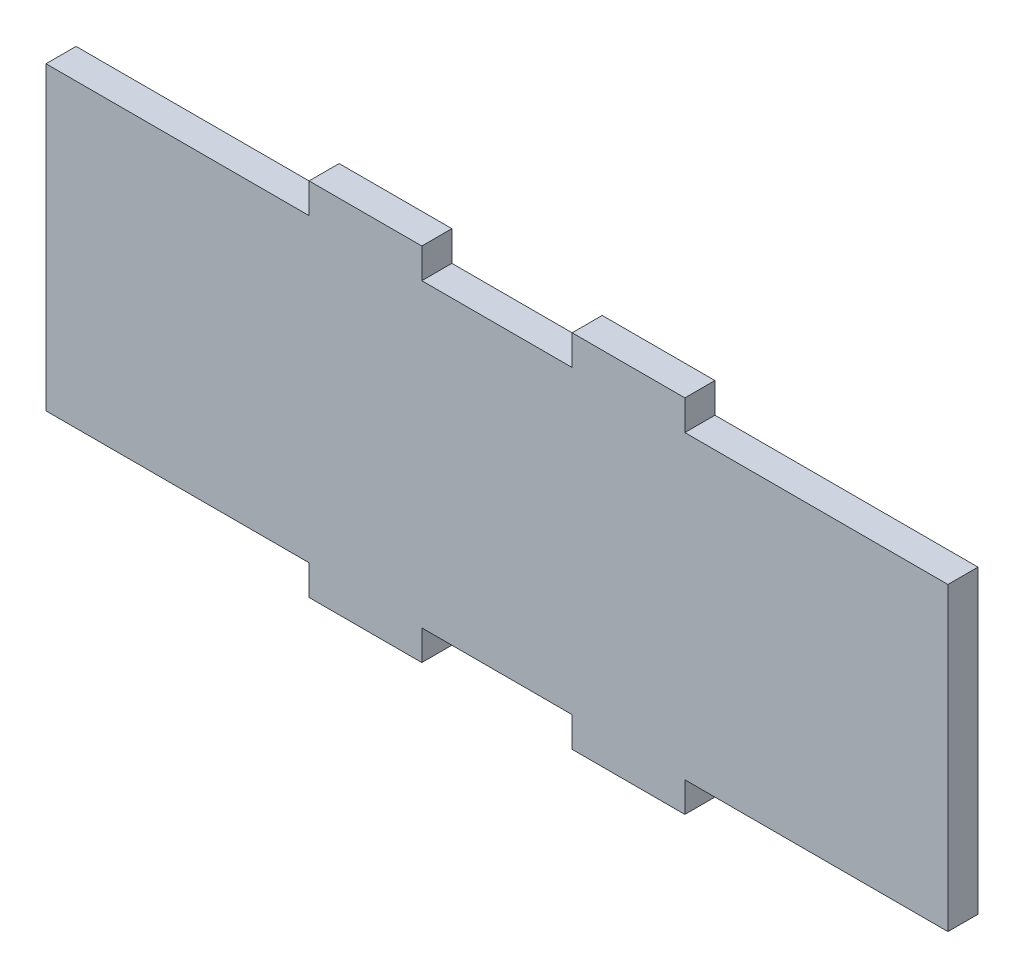
ISO-10303-21;
HEADER;
FILE_DESCRIPTION(('STEP AP214'),'2;1');
FILE_NAME('part.step','',(''),(''),'','','');
FILE_SCHEMA(('AUTOMOTIVE_DESIGN { 1 0 10303 214 1 1 1 1 }'));
ENDSEC;
DATA;
#1=APPLICATION_CONTEXT('core data for automotive mechanical design processes');
#2=APPLICATION_PROTOCOL_DEFINITION('international standard','automotive_design',2000,#1);
#3=PRODUCT_CONTEXT('',#1,'mechanical');
#4=PRODUCT('Part','Part','',(#3));
#5=PRODUCT_RELATED_PRODUCT_CATEGORY('part','',(#4));
#6=PRODUCT_DEFINITION_FORMATION('','',#4);
#7=PRODUCT_DEFINITION_CONTEXT('part definition',#1,'design');
#8=PRODUCT_DEFINITION('design','',#6,#7);
#9=PRODUCT_DEFINITION_SHAPE('','',#8);
#10=(LENGTH_UNIT() NAMED_UNIT(*) SI_UNIT(.MILLI.,.METRE.));
#11=(NAMED_UNIT(*) PLANE_ANGLE_UNIT() SI_UNIT($,.RADIAN.));
#12=(NAMED_UNIT(*) SI_UNIT($,.STERADIAN.) SOLID_ANGLE_UNIT());
#13=UNCERTAINTY_MEASURE_WITH_UNIT(LENGTH_MEASURE(1.E-05),#10,'distance_accuracy_value','');
#14=(GEOMETRIC_REPRESENTATION_CONTEXT(3) GLOBAL_UNCERTAINTY_ASSIGNED_CONTEXT((#13)) GLOBAL_UNIT_ASSIGNED_CONTEXT((#10,
#11,#12)) REPRESENTATION_CONTEXT('',''));
#15=CARTESIAN_POINT('',(0.,0.,0.));
#16=DIRECTION('',(0.,0.,1.));
#17=DIRECTION('',(1.,0.,0.));
#18=AXIS2_PLACEMENT_3D('',#15,#16,#17);
#19=CARTESIAN_POINT('',(60.,48.,-2.));
#20=DIRECTION('',(-1.,0.,0.));
#21=DIRECTION('',(0.,0.,1.));
#22=AXIS2_PLACEMENT_3D('',#19,#20,#21);
#23=PLANE('',#22);
#24=DIRECTION('',(0.,-1.,0.));
#25=VECTOR('',#24,1.);
#26=CARTESIAN_POINT('',(60.,48.,-2.));
#27=LINE('',#26,#25);
#28=CARTESIAN_POINT('',(60.,44.,-2.));
#29=VERTEX_POINT('',#28);
#30=CARTESIAN_POINT('',(60.,4.,-2.));
#31=VERTEX_POINT('',#30);
#32=EDGE_CURVE('E303',#29,#31,#27,.T.);
#33=ORIENTED_EDGE('',*,*,#32,.F.);
#34=DIRECTION('',(0.,0.,1.));
#35=VECTOR('',#34,1.);
#36=CARTESIAN_POINT('',(60.,44.,-46.));
#37=LINE('',#36,#35);
#38=CARTESIAN_POINT('',(60.,44.,2.));
#39=VERTEX_POINT('',#38);
#40=EDGE_CURVE('E202',#29,#39,#37,.T.);
#41=ORIENTED_EDGE('',*,*,#40,.T.);
#42=DIRECTION('',(0.,-1.,0.));
#43=VECTOR('',#42,1.);
#44=CARTESIAN_POINT('',(60.,48.,2.));
#45=LINE('',#44,#43);
#46=CARTESIAN_POINT('',(60.,4.,2.));
#47=VERTEX_POINT('',#46);
#48=EDGE_CURVE('E295',#39,#47,#45,.T.);
#49=ORIENTED_EDGE('',*,*,#48,.T.);
#50=DIRECTION('',(0.,0.,1.));
#51=VECTOR('',#50,1.);
#52=CARTESIAN_POINT('',(60.,4.,-46.));
#53=LINE('',#52,#51);
#54=EDGE_CURVE('E178',#31,#47,#53,.T.);
#55=ORIENTED_EDGE('',*,*,#54,.F.);
#56=EDGE_LOOP('',(#33,#41,#49,#55));
#57=FACE_BOUND('',#56,.T.);
#58=ADVANCED_FACE('F34',(#57),#23,.F.);
#59=CARTESIAN_POINT('',(-60.,48.,-2.));
#60=DIRECTION('',(0.,0.,1.));
#61=DIRECTION('',(1.,0.,0.));
#62=AXIS2_PLACEMENT_3D('',#59,#60,#61);
#63=PLANE('',#62);
#64=DIRECTION('',(-1.,0.,0.));
#65=VECTOR('',#64,1.);
#66=CARTESIAN_POINT('',(-60.,48.,-2.));
#67=LINE('',#66,#65);
#68=CARTESIAN_POINT('',(-10.,48.,-2.));
#69=VERTEX_POINT('',#68);
#70=CARTESIAN_POINT('',(-25.,48.,-2.));
#71=VERTEX_POINT('',#70);
#72=EDGE_CURVE('E282',#69,#71,#67,.T.);
#73=ORIENTED_EDGE('',*,*,#72,.F.);
#74=DIRECTION('',(0.,-1.,0.));
#75=VECTOR('',#74,1.);
#76=CARTESIAN_POINT('',(-10.,48.,-2.));
#77=LINE('',#76,#75);
#78=CARTESIAN_POINT('',(-10.,44.,-2.));
#79=VERTEX_POINT('',#78);
#80=EDGE_CURVE('E263',#69,#79,#77,.T.);
#81=ORIENTED_EDGE('',*,*,#80,.T.);
#82=DIRECTION('',(1.,0.,0.));
#83=VECTOR('',#82,1.);
#84=CARTESIAN_POINT('',(-60.,44.,-2.));
#85=LINE('',#84,#83);
#86=CARTESIAN_POINT('',(10.,44.,-2.));
#87=VERTEX_POINT('',#86);
#88=EDGE_CURVE('E278',#79,#87,#85,.T.);
#89=ORIENTED_EDGE('',*,*,#88,.T.);
#90=DIRECTION('',(0.,-1.,0.));
#91=VECTOR('',#90,1.);
#92=CARTESIAN_POINT('',(9.99999999999999,48.0000000000001,-2.));
#93=LINE('',#92,#91);
#94=CARTESIAN_POINT('',(9.99999999999999,48.,-2.));
#95=VERTEX_POINT('',#94);
#96=EDGE_CURVE('E261',#95,#87,#93,.T.);
#97=ORIENTED_EDGE('',*,*,#96,.F.);
#98=CARTESIAN_POINT('',(25.,48.,-2.));
#99=VERTEX_POINT('',#98);
#100=EDGE_CURVE('E285',#99,#95,#67,.T.);
#101=ORIENTED_EDGE('',*,*,#100,.F.);
#102=DIRECTION('',(0.,-1.,0.));
#103=VECTOR('',#102,1.);
#104=CARTESIAN_POINT('',(25.,48.0000000000001,-2.));
#105=LINE('',#104,#103);
#106=CARTESIAN_POINT('',(25.,44.,-2.));
#107=VERTEX_POINT('',#106);
#108=EDGE_CURVE('E258',#99,#107,#105,.T.);
#109=ORIENTED_EDGE('',*,*,#108,.T.);
#110=DIRECTION('',(1.,0.,0.));
#111=VECTOR('',#110,1.);
#112=CARTESIAN_POINT('',(-60.,44.,-2.));
#113=LINE('',#112,#111);
#114=EDGE_CURVE('E275',#107,#29,#113,.T.);
#115=ORIENTED_EDGE('',*,*,#114,.T.);
#116=ORIENTED_EDGE('',*,*,#32,.T.);
#117=DIRECTION('',(1.,0.,0.));
#118=VECTOR('',#117,1.);
#119=CARTESIAN_POINT('',(-60.,4.,-2.));
#120=LINE('',#119,#118);
#121=CARTESIAN_POINT('',(25.,4.,-2.));
#122=VERTEX_POINT('',#121);
#123=EDGE_CURVE('E269',#122,#31,#120,.T.);
#124=ORIENTED_EDGE('',*,*,#123,.F.);
#125=DIRECTION('',(0.,-1.,0.));
#126=VECTOR('',#125,1.);
#127=CARTESIAN_POINT('',(25.,48.,-2.));
#128=LINE('',#127,#126);
#129=CARTESIAN_POINT('',(25.,0.,-2.));
#130=VERTEX_POINT('',#129);
#131=EDGE_CURVE('E175',#122,#130,#128,.T.);
#132=ORIENTED_EDGE('',*,*,#131,.T.);
#133=DIRECTION('',(-1.,0.,0.));
#134=VECTOR('',#133,1.);
#135=CARTESIAN_POINT('',(-60.,0.,-2.));
#136=LINE('',#135,#134);
#137=CARTESIAN_POINT('',(10.,0.,-2.));
#138=VERTEX_POINT('',#137);
#139=EDGE_CURVE('E293',#130,#138,#136,.T.);
#140=ORIENTED_EDGE('',*,*,#139,.T.);
#141=DIRECTION('',(0.,-1.,0.));
#142=VECTOR('',#141,1.);
#143=CARTESIAN_POINT('',(10.,48.,-2.));
#144=LINE('',#143,#142);
#145=CARTESIAN_POINT('',(10.,4.,-2.));
#146=VERTEX_POINT('',#145);
#147=EDGE_CURVE('E252',#146,#138,#144,.T.);
#148=ORIENTED_EDGE('',*,*,#147,.F.);
#149=DIRECTION('',(1.,0.,0.));
#150=VECTOR('',#149,1.);
#151=CARTESIAN_POINT('',(-60.,4.,-2.));
#152=LINE('',#151,#150);
#153=CARTESIAN_POINT('',(-9.99999999999999,4.,-2.));
#154=VERTEX_POINT('',#153);
#155=EDGE_CURVE('E271',#154,#146,#152,.T.);
#156=ORIENTED_EDGE('',*,*,#155,.F.);
#157=DIRECTION('',(0.,-1.,0.));
#158=VECTOR('',#157,1.);
#159=CARTESIAN_POINT('',(-9.99999999999999,48.,-2.));
#160=LINE('',#159,#158);
#161=CARTESIAN_POINT('',(-9.99999999999999,0.,-2.));
#162=VERTEX_POINT('',#161);
#163=EDGE_CURVE('E249',#154,#162,#160,.T.);
#164=ORIENTED_EDGE('',*,*,#163,.T.);
#165=CARTESIAN_POINT('',(-25.,0.,-2.));
#166=VERTEX_POINT('',#165);
#167=EDGE_CURVE('E281',#162,#166,#136,.T.);
#168=ORIENTED_EDGE('',*,*,#167,.T.);
#169=DIRECTION('',(0.,-1.,0.));
#170=VECTOR('',#169,1.);
#171=CARTESIAN_POINT('',(-25.,48.,-2.));
#172=LINE('',#171,#170);
#173=CARTESIAN_POINT('',(-25.,4.,-2.));
#174=VERTEX_POINT('',#173);
#175=EDGE_CURVE('E254',#174,#166,#172,.T.);
#176=ORIENTED_EDGE('',*,*,#175,.F.);
#177=DIRECTION('',(1.,0.,0.));
#178=VECTOR('',#177,1.);
#179=CARTESIAN_POINT('',(-60.,4.,-2.));
#180=LINE('',#179,#178);
#181=CARTESIAN_POINT('',(-60.,4.,-2.));
#182=VERTEX_POINT('',#181);
#183=EDGE_CURVE('E273',#182,#174,#180,.T.);
#184=ORIENTED_EDGE('',*,*,#183,.F.);
#185=DIRECTION('',(0.,-1.,0.));
#186=VECTOR('',#185,1.);
#187=CARTESIAN_POINT('',(-60.,48.,-2.));
#188=LINE('',#187,#186);
#189=CARTESIAN_POINT('',(-60.,44.,-2.));
#190=VERTEX_POINT('',#189);
#191=EDGE_CURVE('E300',#190,#182,#188,.T.);
#192=ORIENTED_EDGE('',*,*,#191,.F.);
#193=DIRECTION('',(1.,0.,0.));
#194=VECTOR('',#193,1.);
#195=CARTESIAN_POINT('',(-60.,44.,-2.));
#196=LINE('',#195,#194);
#197=CARTESIAN_POINT('',(-25.,44.,-2.));
#198=VERTEX_POINT('',#197);
#199=EDGE_CURVE('E266',#190,#198,#196,.T.);
#200=ORIENTED_EDGE('',*,*,#199,.T.);
#201=DIRECTION('',(0.,-1.,0.));
#202=VECTOR('',#201,1.);
#203=CARTESIAN_POINT('',(-25.,48.,-2.));
#204=LINE('',#203,#202);
#205=EDGE_CURVE('E256',#71,#198,#204,.T.);
#206=ORIENTED_EDGE('',*,*,#205,.F.);
#207=EDGE_LOOP('',(#73,#81,#89,#97,#101,#109,#115,#116,#124,#132,#140,#148,#156,#164,#168,#176,
#184,#192,#200,#206));
#208=FACE_BOUND('',#207,.T.);
#209=ADVANCED_FACE('F332',(#208),#63,.F.);
#210=CARTESIAN_POINT('',(-60.,48.,-2.));
#211=DIRECTION('',(1.,0.,0.));
#212=DIRECTION('',(0.,0.,-1.));
#213=AXIS2_PLACEMENT_3D('',#210,#211,#212);
#214=PLANE('',#213);
#215=DIRECTION('',(0.,0.,1.));
#216=VECTOR('',#215,1.);
#217=CARTESIAN_POINT('',(-60.,4.,-46.));
#218=LINE('',#217,#216);
#219=CARTESIAN_POINT('',(-60.,4.,2.));
#220=VERTEX_POINT('',#219);
#221=EDGE_CURVE('E228',#182,#220,#218,.T.);
#222=ORIENTED_EDGE('',*,*,#221,.T.);
#223=DIRECTION('',(0.,-1.,0.));
#224=VECTOR('',#223,1.);
#225=CARTESIAN_POINT('',(-60.,48.,2.));
#226=LINE('',#225,#224);
#227=CARTESIAN_POINT('',(-60.,44.,2.));
#228=VERTEX_POINT('',#227);
#229=EDGE_CURVE('E297',#228,#220,#226,.T.);
#230=ORIENTED_EDGE('',*,*,#229,.F.);
#231=DIRECTION('',(0.,0.,1.));
#232=VECTOR('',#231,1.);
#233=CARTESIAN_POINT('',(-60.,44.,-46.));
#234=LINE('',#233,#232);
#235=EDGE_CURVE('E244',#190,#228,#234,.T.);
#236=ORIENTED_EDGE('',*,*,#235,.F.);
#237=ORIENTED_EDGE('',*,*,#191,.T.);
#238=EDGE_LOOP('',(#222,#230,#236,#237));
#239=FACE_BOUND('',#238,.T.);
#240=ADVANCED_FACE('F356',(#239),#214,.F.);
#241=CARTESIAN_POINT('',(-60.,48.,2.));
#242=DIRECTION('',(0.,0.,-1.));
#243=DIRECTION('',(-1.,0.,0.));
#244=AXIS2_PLACEMENT_3D('',#241,#242,#243);
#245=PLANE('',#244);
#246=DIRECTION('',(1.,0.,0.));
#247=VECTOR('',#246,1.);
#248=CARTESIAN_POINT('',(0.,44.,2.));
#249=LINE('',#248,#247);
#250=CARTESIAN_POINT('',(-10.,44.,2.));
#251=VERTEX_POINT('',#250);
#252=CARTESIAN_POINT('',(10.,44.,2.));
#253=VERTEX_POINT('',#252);
#254=EDGE_CURVE('E201',#251,#253,#249,.T.);
#255=ORIENTED_EDGE('',*,*,#254,.F.);
#256=DIRECTION('',(0.,-1.,0.));
#257=VECTOR('',#256,1.);
#258=CARTESIAN_POINT('',(-10.,0.,2.));
#259=LINE('',#258,#257);
#260=CARTESIAN_POINT('',(-10.,48.,2.));
#261=VERTEX_POINT('',#260);
#262=EDGE_CURVE('E198',#261,#251,#259,.T.);
#263=ORIENTED_EDGE('',*,*,#262,.F.);
#264=DIRECTION('',(1.,0.,0.));
#265=VECTOR('',#264,1.);
#266=CARTESIAN_POINT('',(-60.,48.,2.));
#267=LINE('',#266,#265);
#268=CARTESIAN_POINT('',(-25.,48.,2.));
#269=VERTEX_POINT('',#268);
#270=EDGE_CURVE('E290',#269,#261,#267,.T.);
#271=ORIENTED_EDGE('',*,*,#270,.F.);
#272=DIRECTION('',(0.,-1.,0.));
#273=VECTOR('',#272,1.);
#274=CARTESIAN_POINT('',(-25.,0.,2.));
#275=LINE('',#274,#273);
#276=CARTESIAN_POINT('',(-25.,44.,2.));
#277=VERTEX_POINT('',#276);
#278=EDGE_CURVE('E56',#269,#277,#275,.T.);
#279=ORIENTED_EDGE('',*,*,#278,.T.);
#280=DIRECTION('',(1.,0.,0.));
#281=VECTOR('',#280,1.);
#282=CARTESIAN_POINT('',(0.,44.,2.));
#283=LINE('',#282,#281);
#284=EDGE_CURVE('E209',#228,#277,#283,.T.);
#285=ORIENTED_EDGE('',*,*,#284,.F.);
#286=ORIENTED_EDGE('',*,*,#229,.T.);
#287=DIRECTION('',(1.,0.,0.));
#288=VECTOR('',#287,1.);
#289=CARTESIAN_POINT('',(0.,4.,2.));
#290=LINE('',#289,#288);
#291=CARTESIAN_POINT('',(-25.,4.,2.));
#292=VERTEX_POINT('',#291);
#293=EDGE_CURVE('E221',#220,#292,#290,.T.);
#294=ORIENTED_EDGE('',*,*,#293,.T.);
#295=DIRECTION('',(0.,-1.,0.));
#296=VECTOR('',#295,1.);
#297=CARTESIAN_POINT('',(-25.,0.,2.));
#298=LINE('',#297,#296);
#299=CARTESIAN_POINT('',(-25.,0.,2.));
#300=VERTEX_POINT('',#299);
#301=EDGE_CURVE('E224',#292,#300,#298,.T.);
#302=ORIENTED_EDGE('',*,*,#301,.T.);
#303=DIRECTION('',(1.,0.,0.));
#304=VECTOR('',#303,1.);
#305=CARTESIAN_POINT('',(-60.,0.,2.));
#306=LINE('',#305,#304);
#307=CARTESIAN_POINT('',(-9.99999999999999,0.,2.));
#308=VERTEX_POINT('',#307);
#309=EDGE_CURVE('E286',#300,#308,#306,.T.);
#310=ORIENTED_EDGE('',*,*,#309,.T.);
#311=DIRECTION('',(0.,-1.,0.));
#312=VECTOR('',#311,1.);
#313=CARTESIAN_POINT('',(-9.99999999999999,0.,2.));
#314=LINE('',#313,#312);
#315=CARTESIAN_POINT('',(-9.99999999999999,4.,2.));
#316=VERTEX_POINT('',#315);
#317=EDGE_CURVE('E234',#316,#308,#314,.T.);
#318=ORIENTED_EDGE('',*,*,#317,.F.);
#319=DIRECTION('',(1.,0.,0.));
#320=VECTOR('',#319,1.);
#321=CARTESIAN_POINT('',(0.,4.,2.));
#322=LINE('',#321,#320);
#323=CARTESIAN_POINT('',(10.,4.,2.));
#324=VERTEX_POINT('',#323);
#325=EDGE_CURVE('E196',#316,#324,#322,.T.);
#326=ORIENTED_EDGE('',*,*,#325,.T.);
#327=DIRECTION('',(0.,-1.,0.));
#328=VECTOR('',#327,1.);
#329=CARTESIAN_POINT('',(10.,0.,2.));
#330=LINE('',#329,#328);
#331=CARTESIAN_POINT('',(10.,0.,2.));
#332=VERTEX_POINT('',#331);
#333=EDGE_CURVE('E236',#324,#332,#330,.T.);
#334=ORIENTED_EDGE('',*,*,#333,.T.);
#335=CARTESIAN_POINT('',(25.,0.,2.));
#336=VERTEX_POINT('',#335);
#337=EDGE_CURVE('E193',#332,#336,#306,.T.);
#338=ORIENTED_EDGE('',*,*,#337,.T.);
#339=DIRECTION('',(0.,-1.,0.));
#340=VECTOR('',#339,1.);
#341=CARTESIAN_POINT('',(25.,0.,2.));
#342=LINE('',#341,#340);
#343=CARTESIAN_POINT('',(25.,4.,2.));
#344=VERTEX_POINT('',#343);
#345=EDGE_CURVE('E172',#344,#336,#342,.T.);
#346=ORIENTED_EDGE('',*,*,#345,.F.);
#347=DIRECTION('',(1.,0.,0.));
#348=VECTOR('',#347,1.);
#349=CARTESIAN_POINT('',(0.,4.,2.));
#350=LINE('',#349,#348);
#351=EDGE_CURVE('E181',#344,#47,#350,.T.);
#352=ORIENTED_EDGE('',*,*,#351,.T.);
#353=ORIENTED_EDGE('',*,*,#48,.F.);
#354=DIRECTION('',(1.,0.,0.));
#355=VECTOR('',#354,1.);
#356=CARTESIAN_POINT('',(0.,44.,2.));
#357=LINE('',#356,#355);
#358=CARTESIAN_POINT('',(25.,44.,2.));
#359=VERTEX_POINT('',#358);
#360=EDGE_CURVE('E214',#359,#39,#357,.T.);
#361=ORIENTED_EDGE('',*,*,#360,.F.);
#362=DIRECTION('',(0.,-1.,0.));
#363=VECTOR('',#362,1.);
#364=CARTESIAN_POINT('',(25.0000000000001,0.,2.));
#365=LINE('',#364,#363);
#366=CARTESIAN_POINT('',(25.,48.,2.));
#367=VERTEX_POINT('',#366);
#368=EDGE_CURVE('E211',#367,#359,#365,.T.);
#369=ORIENTED_EDGE('',*,*,#368,.F.);
#370=CARTESIAN_POINT('',(9.99999999999999,48.,2.));
#371=VERTEX_POINT('',#370);
#372=EDGE_CURVE('E287',#371,#367,#267,.T.);
#373=ORIENTED_EDGE('',*,*,#372,.F.);
#374=DIRECTION('',(0.,-1.,0.));
#375=VECTOR('',#374,1.);
#376=CARTESIAN_POINT('',(10.0000000000001,0.,2.));
#377=LINE('',#376,#375);
#378=EDGE_CURVE('E48',#371,#253,#377,.T.);
#379=ORIENTED_EDGE('',*,*,#378,.T.);
#380=EDGE_LOOP('',(#255,#263,#271,#279,#285,#286,#294,#302,#310,#318,#326,#334,#338,#346,#352,
#353,#361,#369,#373,#379));
#381=FACE_BOUND('',#380,.T.);
#382=ADVANCED_FACE('F190',(#381),#245,.F.);
#383=CARTESIAN_POINT('',(0.,48.,0.));
#384=DIRECTION('',(0.,1.,0.));
#385=DIRECTION('',(0.,0.,1.));
#386=AXIS2_PLACEMENT_3D('',#383,#384,#385);
#387=PLANE('',#386);
#388=ORIENTED_EDGE('',*,*,#100,.T.);
#389=DIRECTION('',(0.,0.,1.));
#390=VECTOR('',#389,1.);
#391=CARTESIAN_POINT('',(9.99999999999999,48.,0.));
#392=LINE('',#391,#390);
#393=EDGE_CURVE('E41',#95,#371,#392,.T.);
#394=ORIENTED_EDGE('',*,*,#393,.T.);
#395=ORIENTED_EDGE('',*,*,#372,.T.);
#396=DIRECTION('',(0.,0.,1.));
#397=VECTOR('',#396,1.);
#398=CARTESIAN_POINT('',(25.,48.,0.));
#399=LINE('',#398,#397);
#400=EDGE_CURVE('E317',#99,#367,#399,.T.);
#401=ORIENTED_EDGE('',*,*,#400,.F.);
#402=EDGE_LOOP('',(#388,#394,#395,#401));
#403=FACE_BOUND('',#402,.T.);
#404=ADVANCED_FACE('F321',(#403),#387,.T.);
#405=DIRECTION('',(0.,0.,1.));
#406=VECTOR('',#405,1.);
#407=CARTESIAN_POINT('',(-10.,48.,0.));
#408=LINE('',#407,#406);
#409=EDGE_CURVE('E11',#69,#261,#408,.T.);
#410=ORIENTED_EDGE('',*,*,#409,.F.);
#411=ORIENTED_EDGE('',*,*,#72,.T.);
#412=DIRECTION('',(0.,0.,1.));
#413=VECTOR('',#412,1.);
#414=CARTESIAN_POINT('',(-25.,48.,0.));
#415=LINE('',#414,#413);
#416=EDGE_CURVE('E315',#71,#269,#415,.T.);
#417=ORIENTED_EDGE('',*,*,#416,.T.);
#418=ORIENTED_EDGE('',*,*,#270,.T.);
#419=EDGE_LOOP('',(#410,#411,#417,#418));
#420=FACE_BOUND('',#419,.T.);
#421=ADVANCED_FACE('F344',(#420),#387,.T.);
#422=CARTESIAN_POINT('',(0.,0.,0.));
#423=DIRECTION('',(0.,1.,0.));
#424=DIRECTION('',(0.,0.,1.));
#425=AXIS2_PLACEMENT_3D('',#422,#423,#424);
#426=PLANE('',#425);
#427=DIRECTION('',(0.,0.,1.));
#428=VECTOR('',#427,1.);
#429=CARTESIAN_POINT('',(-25.,0.,0.));
#430=LINE('',#429,#428);
#431=EDGE_CURVE('E313',#166,#300,#430,.T.);
#432=ORIENTED_EDGE('',*,*,#431,.F.);
#433=ORIENTED_EDGE('',*,*,#167,.F.);
#434=DIRECTION('',(0.,0.,1.));
#435=VECTOR('',#434,1.);
#436=CARTESIAN_POINT('',(-9.99999999999999,0.,0.));
#437=LINE('',#436,#435);
#438=EDGE_CURVE('E308',#162,#308,#437,.T.);
#439=ORIENTED_EDGE('',*,*,#438,.T.);
#440=ORIENTED_EDGE('',*,*,#309,.F.);
#441=EDGE_LOOP('',(#432,#433,#439,#440));
#442=FACE_BOUND('',#441,.T.);
#443=ADVANCED_FACE('F369',(#442),#426,.F.);
#444=DIRECTION('',(0.,0.,1.));
#445=VECTOR('',#444,1.);
#446=CARTESIAN_POINT('',(10.,0.,0.));
#447=LINE('',#446,#445);
#448=EDGE_CURVE('E311',#138,#332,#447,.T.);
#449=ORIENTED_EDGE('',*,*,#448,.F.);
#450=ORIENTED_EDGE('',*,*,#139,.F.);
#451=DIRECTION('',(0.,0.,1.));
#452=VECTOR('',#451,1.);
#453=CARTESIAN_POINT('',(25.,0.,0.));
#454=LINE('',#453,#452);
#455=EDGE_CURVE('E306',#130,#336,#454,.T.);
#456=ORIENTED_EDGE('',*,*,#455,.T.);
#457=ORIENTED_EDGE('',*,*,#337,.F.);
#458=EDGE_LOOP('',(#449,#450,#456,#457));
#459=FACE_BOUND('',#458,.T.);
#460=ADVANCED_FACE('F384',(#459),#426,.F.);
#461=CARTESIAN_POINT('',(0.,4.,-46.));
#462=DIRECTION('',(0.,-1.,0.));
#463=DIRECTION('',(1.,0.,0.));
#464=AXIS2_PLACEMENT_3D('',#461,#462,#463);
#465=PLANE('',#464);
#466=ORIENTED_EDGE('',*,*,#123,.T.);
#467=ORIENTED_EDGE('',*,*,#54,.T.);
#468=ORIENTED_EDGE('',*,*,#351,.F.);
#469=DIRECTION('',(0.,0.,1.));
#470=VECTOR('',#469,1.);
#471=CARTESIAN_POINT('',(25.,4.,-46.));
#472=LINE('',#471,#470);
#473=EDGE_CURVE('E168',#122,#344,#472,.T.);
#474=ORIENTED_EDGE('',*,*,#473,.F.);
#475=EDGE_LOOP('',(#466,#467,#468,#474));
#476=FACE_BOUND('',#475,.T.);
#477=ADVANCED_FACE('F182',(#476),#465,.T.);
#478=CARTESIAN_POINT('',(25.,0.,-46.));
#479=DIRECTION('',(-1.,0.,0.));
#480=DIRECTION('',(0.,0.,1.));
#481=AXIS2_PLACEMENT_3D('',#478,#479,#480);
#482=PLANE('',#481);
#483=ORIENTED_EDGE('',*,*,#473,.T.);
#484=ORIENTED_EDGE('',*,*,#345,.T.);
#485=ORIENTED_EDGE('',*,*,#455,.F.);
#486=ORIENTED_EDGE('',*,*,#131,.F.);
#487=EDGE_LOOP('',(#483,#484,#485,#486));
#488=FACE_BOUND('',#487,.T.);
#489=ADVANCED_FACE('F170',(#488),#482,.F.);
#490=CARTESIAN_POINT('',(0.,4.,-46.));
#491=DIRECTION('',(0.,-1.,0.));
#492=DIRECTION('',(1.,0.,0.));
#493=AXIS2_PLACEMENT_3D('',#490,#491,#492);
#494=PLANE('',#493);
#495=ORIENTED_EDGE('',*,*,#155,.T.);
#496=DIRECTION('',(0.,0.,1.));
#497=VECTOR('',#496,1.);
#498=CARTESIAN_POINT('',(10.,4.,-46.));
#499=LINE('',#498,#497);
#500=EDGE_CURVE('E225',#146,#324,#499,.T.);
#501=ORIENTED_EDGE('',*,*,#500,.T.);
#502=ORIENTED_EDGE('',*,*,#325,.F.);
#503=DIRECTION('',(0.,0.,1.));
#504=VECTOR('',#503,1.);
#505=CARTESIAN_POINT('',(-9.99999999999999,4.,-46.));
#506=LINE('',#505,#504);
#507=EDGE_CURVE('E238',#154,#316,#506,.T.);
#508=ORIENTED_EDGE('',*,*,#507,.F.);
#509=EDGE_LOOP('',(#495,#501,#502,#508));
#510=FACE_BOUND('',#509,.T.);
#511=ADVANCED_FACE('F377',(#510),#494,.T.);
#512=CARTESIAN_POINT('',(10.,0.,-46.));
#513=DIRECTION('',(-1.,0.,0.));
#514=DIRECTION('',(0.,0.,1.));
#515=AXIS2_PLACEMENT_3D('',#512,#513,#514);
#516=PLANE('',#515);
#517=ORIENTED_EDGE('',*,*,#147,.T.);
#518=ORIENTED_EDGE('',*,*,#448,.T.);
#519=ORIENTED_EDGE('',*,*,#333,.F.);
#520=ORIENTED_EDGE('',*,*,#500,.F.);
#521=EDGE_LOOP('',(#517,#518,#519,#520));
#522=FACE_BOUND('',#521,.T.);
#523=ADVANCED_FACE('F419',(#522),#516,.T.);
#524=CARTESIAN_POINT('',(-9.99999999999999,0.,-46.));
#525=DIRECTION('',(-1.,0.,0.));
#526=DIRECTION('',(0.,0.,1.));
#527=AXIS2_PLACEMENT_3D('',#524,#525,#526);
#528=PLANE('',#527);
#529=ORIENTED_EDGE('',*,*,#507,.T.);
#530=ORIENTED_EDGE('',*,*,#317,.T.);
#531=ORIENTED_EDGE('',*,*,#438,.F.);
#532=ORIENTED_EDGE('',*,*,#163,.F.);
#533=EDGE_LOOP('',(#529,#530,#531,#532));
#534=FACE_BOUND('',#533,.T.);
#535=ADVANCED_FACE('F374',(#534),#528,.F.);
#536=CARTESIAN_POINT('',(0.,4.,-46.));
#537=DIRECTION('',(0.,-1.,0.));
#538=DIRECTION('',(1.,0.,0.));
#539=AXIS2_PLACEMENT_3D('',#536,#537,#538);
#540=PLANE('',#539);
#541=ORIENTED_EDGE('',*,*,#183,.T.);
#542=DIRECTION('',(0.,0.,1.));
#543=VECTOR('',#542,1.);
#544=CARTESIAN_POINT('',(-25.,4.,-46.));
#545=LINE('',#544,#543);
#546=EDGE_CURVE('E215',#174,#292,#545,.T.);
#547=ORIENTED_EDGE('',*,*,#546,.T.);
#548=ORIENTED_EDGE('',*,*,#293,.F.);
#549=ORIENTED_EDGE('',*,*,#221,.F.);
#550=EDGE_LOOP('',(#541,#547,#548,#549));
#551=FACE_BOUND('',#550,.T.);
#552=ADVANCED_FACE('F361',(#551),#540,.T.);
#553=CARTESIAN_POINT('',(-25.,0.,-46.));
#554=DIRECTION('',(-1.,0.,0.));
#555=DIRECTION('',(0.,0.,1.));
#556=AXIS2_PLACEMENT_3D('',#553,#554,#555);
#557=PLANE('',#556);
#558=ORIENTED_EDGE('',*,*,#175,.T.);
#559=ORIENTED_EDGE('',*,*,#431,.T.);
#560=ORIENTED_EDGE('',*,*,#301,.F.);
#561=ORIENTED_EDGE('',*,*,#546,.F.);
#562=EDGE_LOOP('',(#558,#559,#560,#561));
#563=FACE_BOUND('',#562,.T.);
#564=ADVANCED_FACE('F365',(#563),#557,.T.);
#565=CARTESIAN_POINT('',(0.,44.,-46.));
#566=DIRECTION('',(0.,-1.,0.));
#567=DIRECTION('',(0.,0.,-1.));
#568=AXIS2_PLACEMENT_3D('',#565,#566,#567);
#569=PLANE('',#568);
#570=ORIENTED_EDGE('',*,*,#235,.T.);
#571=ORIENTED_EDGE('',*,*,#284,.T.);
#572=DIRECTION('',(0.,0.,1.));
#573=VECTOR('',#572,1.);
#574=CARTESIAN_POINT('',(-25.,44.,-46.));
#575=LINE('',#574,#573);
#576=EDGE_CURVE('E245',#198,#277,#575,.T.);
#577=ORIENTED_EDGE('',*,*,#576,.F.);
#578=ORIENTED_EDGE('',*,*,#199,.F.);
#579=EDGE_LOOP('',(#570,#571,#577,#578));
#580=FACE_BOUND('',#579,.T.);
#581=ADVANCED_FACE('F352',(#580),#569,.F.);
#582=CARTESIAN_POINT('',(-25.,0.,-46.));
#583=DIRECTION('',(-1.,0.,0.));
#584=DIRECTION('',(0.,0.,1.));
#585=AXIS2_PLACEMENT_3D('',#582,#583,#584);
#586=PLANE('',#585);
#587=ORIENTED_EDGE('',*,*,#205,.T.);
#588=ORIENTED_EDGE('',*,*,#576,.T.);
#589=ORIENTED_EDGE('',*,*,#278,.F.);
#590=ORIENTED_EDGE('',*,*,#416,.F.);
#591=EDGE_LOOP('',(#587,#588,#589,#590));
#592=FACE_BOUND('',#591,.T.);
#593=ADVANCED_FACE('F346',(#592),#586,.T.);
#594=CARTESIAN_POINT('',(0.,44.,-46.));
#595=DIRECTION('',(0.,-1.,0.));
#596=DIRECTION('',(0.,0.,-1.));
#597=AXIS2_PLACEMENT_3D('',#594,#595,#596);
#598=PLANE('',#597);
#599=DIRECTION('',(0.,0.,1.));
#600=VECTOR('',#599,1.);
#601=CARTESIAN_POINT('',(25.,44.,-46.));
#602=LINE('',#601,#600);
#603=EDGE_CURVE('E217',#107,#359,#602,.T.);
#604=ORIENTED_EDGE('',*,*,#603,.T.);
#605=ORIENTED_EDGE('',*,*,#360,.T.);
#606=ORIENTED_EDGE('',*,*,#40,.F.);
#607=ORIENTED_EDGE('',*,*,#114,.F.);
#608=EDGE_LOOP('',(#604,#605,#606,#607));
#609=FACE_BOUND('',#608,.T.);
#610=ADVANCED_FACE('F390',(#609),#598,.F.);
#611=CARTESIAN_POINT('',(25.0000000000001,0.,-46.));
#612=DIRECTION('',(-1.,0.,0.));
#613=DIRECTION('',(0.,-1.,0.));
#614=AXIS2_PLACEMENT_3D('',#611,#612,#613);
#615=PLANE('',#614);
#616=ORIENTED_EDGE('',*,*,#400,.T.);
#617=ORIENTED_EDGE('',*,*,#368,.T.);
#618=ORIENTED_EDGE('',*,*,#603,.F.);
#619=ORIENTED_EDGE('',*,*,#108,.F.);
#620=EDGE_LOOP('',(#616,#617,#618,#619));
#621=FACE_BOUND('',#620,.T.);
#622=ADVANCED_FACE('F329',(#621),#615,.F.);
#623=CARTESIAN_POINT('',(0.,44.,-46.));
#624=DIRECTION('',(0.,-1.,0.));
#625=DIRECTION('',(0.,0.,-1.));
#626=AXIS2_PLACEMENT_3D('',#623,#624,#625);
#627=PLANE('',#626);
#628=DIRECTION('',(0.,0.,1.));
#629=VECTOR('',#628,1.);
#630=CARTESIAN_POINT('',(-10.,44.,-46.));
#631=LINE('',#630,#629);
#632=EDGE_CURVE('E206',#79,#251,#631,.T.);
#633=ORIENTED_EDGE('',*,*,#632,.T.);
#634=ORIENTED_EDGE('',*,*,#254,.T.);
#635=DIRECTION('',(0.,0.,1.));
#636=VECTOR('',#635,1.);
#637=CARTESIAN_POINT('',(10.,44.,-46.));
#638=LINE('',#637,#636);
#639=EDGE_CURVE('E207',#87,#253,#638,.T.);
#640=ORIENTED_EDGE('',*,*,#639,.F.);
#641=ORIENTED_EDGE('',*,*,#88,.F.);
#642=EDGE_LOOP('',(#633,#634,#640,#641));
#643=FACE_BOUND('',#642,.T.);
#644=ADVANCED_FACE('F336',(#643),#627,.F.);
#645=CARTESIAN_POINT('',(-10.,0.,-46.));
#646=DIRECTION('',(-1.,0.,0.));
#647=DIRECTION('',(0.,0.,1.));
#648=AXIS2_PLACEMENT_3D('',#645,#646,#647);
#649=PLANE('',#648);
#650=ORIENTED_EDGE('',*,*,#409,.T.);
#651=ORIENTED_EDGE('',*,*,#262,.T.);
#652=ORIENTED_EDGE('',*,*,#632,.F.);
#653=ORIENTED_EDGE('',*,*,#80,.F.);
#654=EDGE_LOOP('',(#650,#651,#652,#653));
#655=FACE_BOUND('',#654,.T.);
#656=ADVANCED_FACE('F458',(#655),#649,.F.);
#657=CARTESIAN_POINT('',(10.0000000000001,0.,-46.));
#658=DIRECTION('',(-1.,0.,0.));
#659=DIRECTION('',(0.,-1.,0.));
#660=AXIS2_PLACEMENT_3D('',#657,#658,#659);
#661=PLANE('',#660);
#662=ORIENTED_EDGE('',*,*,#96,.T.);
#663=ORIENTED_EDGE('',*,*,#639,.T.);
#664=ORIENTED_EDGE('',*,*,#378,.F.);
#665=ORIENTED_EDGE('',*,*,#393,.F.);
#666=EDGE_LOOP('',(#662,#663,#664,#665));
#667=FACE_BOUND('',#666,.T.);
#668=ADVANCED_FACE('F334',(#667),#661,.T.);
#669=CLOSED_SHELL('',(#58,#209,#240,#382,#404,#421,#443,#460,#477,#489,#511,#523,#535,#552,#564,
#581,#593,#610,#622,#644,#656,#668));
#670=MANIFOLD_SOLID_BREP('B2',#669);
#671=ADVANCED_BREP_SHAPE_REPRESENTATION('',(#18,#670),#14);
#672=SHAPE_DEFINITION_REPRESENTATION(#9,#671);
ENDSEC;
END-ISO-10303-21;
